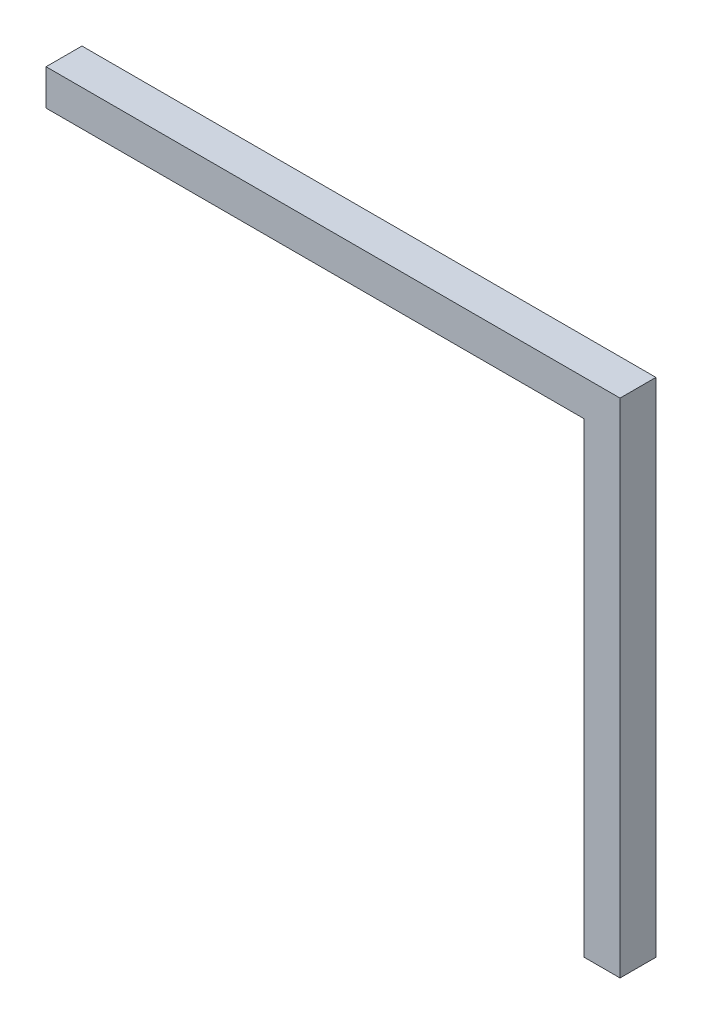
ISO-10303-21;
HEADER;
FILE_DESCRIPTION(('STEP AP214'),'2;1');
FILE_NAME('part.step','',(''),(''),'','','');
FILE_SCHEMA(('AUTOMOTIVE_DESIGN { 1 0 10303 214 1 1 1 1 }'));
ENDSEC;
DATA;
#1=APPLICATION_CONTEXT('core data for automotive mechanical design processes');
#2=APPLICATION_PROTOCOL_DEFINITION('international standard','automotive_design',2000,#1);
#3=PRODUCT_CONTEXT('',#1,'mechanical');
#4=PRODUCT('Part','Part','',(#3));
#5=PRODUCT_RELATED_PRODUCT_CATEGORY('part','',(#4));
#6=PRODUCT_DEFINITION_FORMATION('','',#4);
#7=PRODUCT_DEFINITION_CONTEXT('part definition',#1,'design');
#8=PRODUCT_DEFINITION('design','',#6,#7);
#9=PRODUCT_DEFINITION_SHAPE('','',#8);
#10=(LENGTH_UNIT() NAMED_UNIT(*) SI_UNIT(.MILLI.,.METRE.));
#11=(NAMED_UNIT(*) PLANE_ANGLE_UNIT() SI_UNIT($,.RADIAN.));
#12=(NAMED_UNIT(*) SI_UNIT($,.STERADIAN.) SOLID_ANGLE_UNIT());
#13=UNCERTAINTY_MEASURE_WITH_UNIT(LENGTH_MEASURE(1.E-05),#10,'distance_accuracy_value','');
#14=(GEOMETRIC_REPRESENTATION_CONTEXT(3) GLOBAL_UNCERTAINTY_ASSIGNED_CONTEXT((#13)) GLOBAL_UNIT_ASSIGNED_CONTEXT((#10,
#11,#12)) REPRESENTATION_CONTEXT('',''));
#15=CARTESIAN_POINT('',(0.,0.,0.));
#16=DIRECTION('',(0.,0.,1.));
#17=DIRECTION('',(1.,0.,0.));
#18=AXIS2_PLACEMENT_3D('',#15,#16,#17);
#19=CARTESIAN_POINT('',(-5.69999999999999,0.,0.5));
#20=DIRECTION('',(-1.,0.,0.));
#21=DIRECTION('',(0.,0.,1.));
#22=AXIS2_PLACEMENT_3D('',#19,#20,#21);
#23=PLANE('',#22);
#24=DIRECTION('',(0.,1.,0.));
#25=VECTOR('',#24,1.);
#26=CARTESIAN_POINT('',(-5.69999999999999,0.,0.));
#27=LINE('',#26,#25);
#28=CARTESIAN_POINT('',(-5.69999999999999,10.5626465300252,0.));
#29=VERTEX_POINT('',#28);
#30=CARTESIAN_POINT('',(-5.69999999999999,17.0626465300252,0.));
#31=VERTEX_POINT('',#30);
#32=EDGE_CURVE('E129',#29,#31,#27,.T.);
#33=ORIENTED_EDGE('',*,*,#32,.F.);
#34=DIRECTION('',(0.,0.,-1.));
#35=VECTOR('',#34,1.);
#36=CARTESIAN_POINT('',(-5.69999999999999,10.5626465300252,0.5));
#37=LINE('',#36,#35);
#38=CARTESIAN_POINT('',(-5.69999999999999,10.5626465300252,0.5));
#39=VERTEX_POINT('',#38);
#40=EDGE_CURVE('E11',#39,#29,#37,.T.);
#41=ORIENTED_EDGE('',*,*,#40,.F.);
#42=DIRECTION('',(0.,1.,0.));
#43=VECTOR('',#42,1.);
#44=CARTESIAN_POINT('',(-5.69999999999999,0.,0.5));
#45=LINE('',#44,#43);
#46=CARTESIAN_POINT('',(-5.69999999999999,17.0626465300252,0.5));
#47=VERTEX_POINT('',#46);
#48=EDGE_CURVE('E148',#39,#47,#45,.T.);
#49=ORIENTED_EDGE('',*,*,#48,.T.);
#50=DIRECTION('',(0.,0.,-1.));
#51=VECTOR('',#50,1.);
#52=CARTESIAN_POINT('',(-5.69999999999999,17.0626465300252,0.5));
#53=LINE('',#52,#51);
#54=EDGE_CURVE('E86',#47,#31,#53,.T.);
#55=ORIENTED_EDGE('',*,*,#54,.T.);
#56=EDGE_LOOP('',(#33,#41,#49,#55));
#57=FACE_BOUND('',#56,.T.);
#58=ADVANCED_FACE('F41',(#57),#23,.T.);
#59=CARTESIAN_POINT('',(0.,10.5626465300252,0.5));
#60=DIRECTION('',(0.,1.,0.));
#61=DIRECTION('',(0.,0.,1.));
#62=AXIS2_PLACEMENT_3D('',#59,#60,#61);
#63=PLANE('',#62);
#64=DIRECTION('',(1.,0.,0.));
#65=VECTOR('',#64,1.);
#66=CARTESIAN_POINT('',(0.,10.5626465300252,0.));
#67=LINE('',#66,#65);
#68=CARTESIAN_POINT('',(-5.19999999999999,10.5626465300252,0.));
#69=VERTEX_POINT('',#68);
#70=EDGE_CURVE('E133',#29,#69,#67,.T.);
#71=ORIENTED_EDGE('',*,*,#70,.T.);
#72=DIRECTION('',(0.,0.,-1.));
#73=VECTOR('',#72,1.);
#74=CARTESIAN_POINT('',(-5.19999999999999,10.5626465300252,0.5));
#75=LINE('',#74,#73);
#76=CARTESIAN_POINT('',(-5.19999999999999,10.5626465300252,0.5));
#77=VERTEX_POINT('',#76);
#78=EDGE_CURVE('E50',#77,#69,#75,.T.);
#79=ORIENTED_EDGE('',*,*,#78,.F.);
#80=DIRECTION('',(1.,0.,0.));
#81=VECTOR('',#80,1.);
#82=CARTESIAN_POINT('',(0.,10.5626465300252,0.5));
#83=LINE('',#82,#81);
#84=EDGE_CURVE('E123',#39,#77,#83,.T.);
#85=ORIENTED_EDGE('',*,*,#84,.F.);
#86=ORIENTED_EDGE('',*,*,#40,.T.);
#87=EDGE_LOOP('',(#71,#79,#85,#86));
#88=FACE_BOUND('',#87,.T.);
#89=ADVANCED_FACE('F161',(#88),#63,.F.);
#90=CARTESIAN_POINT('',(-5.19999999999999,0.,0.5));
#91=DIRECTION('',(1.,0.,0.));
#92=DIRECTION('',(0.,1.,0.));
#93=AXIS2_PLACEMENT_3D('',#90,#91,#92);
#94=PLANE('',#93);
#95=DIRECTION('',(0.,-1.,0.));
#96=VECTOR('',#95,1.);
#97=CARTESIAN_POINT('',(-5.19999999999999,0.,0.));
#98=LINE('',#97,#96);
#99=CARTESIAN_POINT('',(-5.19999999999999,17.5626465300252,0.));
#100=VERTEX_POINT('',#99);
#101=EDGE_CURVE('E137',#100,#69,#98,.T.);
#102=ORIENTED_EDGE('',*,*,#101,.F.);
#103=DIRECTION('',(0.,0.,-1.));
#104=VECTOR('',#103,1.);
#105=CARTESIAN_POINT('',(-5.19999999999999,17.5626465300252,0.5));
#106=LINE('',#105,#104);
#107=CARTESIAN_POINT('',(-5.19999999999999,17.5626465300252,0.5));
#108=VERTEX_POINT('',#107);
#109=EDGE_CURVE('E109',#108,#100,#106,.T.);
#110=ORIENTED_EDGE('',*,*,#109,.F.);
#111=DIRECTION('',(0.,-1.,0.));
#112=VECTOR('',#111,1.);
#113=CARTESIAN_POINT('',(-5.19999999999999,0.,0.5));
#114=LINE('',#113,#112);
#115=EDGE_CURVE('E119',#108,#77,#114,.T.);
#116=ORIENTED_EDGE('',*,*,#115,.T.);
#117=ORIENTED_EDGE('',*,*,#78,.T.);
#118=EDGE_LOOP('',(#102,#110,#116,#117));
#119=FACE_BOUND('',#118,.T.);
#120=ADVANCED_FACE('F158',(#119),#94,.T.);
#121=CARTESIAN_POINT('',(0.,17.5626465300252,0.5));
#122=DIRECTION('',(0.,1.,0.));
#123=DIRECTION('',(0.,0.,1.));
#124=AXIS2_PLACEMENT_3D('',#121,#122,#123);
#125=PLANE('',#124);
#126=DIRECTION('',(1.,0.,0.));
#127=VECTOR('',#126,1.);
#128=CARTESIAN_POINT('',(0.,17.5626465300252,0.));
#129=LINE('',#128,#127);
#130=CARTESIAN_POINT('',(-13.2,17.5626465300252,0.));
#131=VERTEX_POINT('',#130);
#132=EDGE_CURVE('E107',#131,#100,#129,.T.);
#133=ORIENTED_EDGE('',*,*,#132,.F.);
#134=DIRECTION('',(0.,0.,-1.));
#135=VECTOR('',#134,1.);
#136=CARTESIAN_POINT('',(-13.2,17.5626465300252,0.5));
#137=LINE('',#136,#135);
#138=CARTESIAN_POINT('',(-13.2,17.5626465300252,0.5));
#139=VERTEX_POINT('',#138);
#140=EDGE_CURVE('E101',#139,#131,#137,.T.);
#141=ORIENTED_EDGE('',*,*,#140,.F.);
#142=DIRECTION('',(1.,0.,0.));
#143=VECTOR('',#142,1.);
#144=CARTESIAN_POINT('',(0.,17.5626465300252,0.5));
#145=LINE('',#144,#143);
#146=EDGE_CURVE('E105',#139,#108,#145,.T.);
#147=ORIENTED_EDGE('',*,*,#146,.T.);
#148=ORIENTED_EDGE('',*,*,#109,.T.);
#149=EDGE_LOOP('',(#133,#141,#147,#148));
#150=FACE_BOUND('',#149,.T.);
#151=ADVANCED_FACE('F103',(#150),#125,.T.);
#152=CARTESIAN_POINT('',(-13.2,0.,0.5));
#153=DIRECTION('',(1.,0.,0.));
#154=DIRECTION('',(0.,0.,-1.));
#155=AXIS2_PLACEMENT_3D('',#152,#153,#154);
#156=PLANE('',#155);
#157=DIRECTION('',(0.,-1.,0.));
#158=VECTOR('',#157,1.);
#159=CARTESIAN_POINT('',(-13.2,0.,0.));
#160=LINE('',#159,#158);
#161=CARTESIAN_POINT('',(-13.2,17.0626465300252,0.));
#162=VERTEX_POINT('',#161);
#163=EDGE_CURVE('E79',#131,#162,#160,.T.);
#164=ORIENTED_EDGE('',*,*,#163,.T.);
#165=DIRECTION('',(0.,0.,-1.));
#166=VECTOR('',#165,1.);
#167=CARTESIAN_POINT('',(-13.2,17.0626465300252,0.5));
#168=LINE('',#167,#166);
#169=CARTESIAN_POINT('',(-13.2,17.0626465300252,0.5));
#170=VERTEX_POINT('',#169);
#171=EDGE_CURVE('E110',#170,#162,#168,.T.);
#172=ORIENTED_EDGE('',*,*,#171,.F.);
#173=DIRECTION('',(0.,-1.,0.));
#174=VECTOR('',#173,1.);
#175=CARTESIAN_POINT('',(-13.2,0.,0.5));
#176=LINE('',#175,#174);
#177=EDGE_CURVE('E112',#139,#170,#176,.T.);
#178=ORIENTED_EDGE('',*,*,#177,.F.);
#179=ORIENTED_EDGE('',*,*,#140,.T.);
#180=EDGE_LOOP('',(#164,#172,#178,#179));
#181=FACE_BOUND('',#180,.T.);
#182=ADVANCED_FACE('F113',(#181),#156,.F.);
#183=CARTESIAN_POINT('',(0.,17.0626465300252,0.5));
#184=DIRECTION('',(0.,1.,0.));
#185=DIRECTION('',(0.,0.,1.));
#186=AXIS2_PLACEMENT_3D('',#183,#184,#185);
#187=PLANE('',#186);
#188=DIRECTION('',(1.,0.,0.));
#189=VECTOR('',#188,1.);
#190=CARTESIAN_POINT('',(0.,17.0626465300252,0.));
#191=LINE('',#190,#189);
#192=EDGE_CURVE('E145',#162,#31,#191,.T.);
#193=ORIENTED_EDGE('',*,*,#192,.T.);
#194=ORIENTED_EDGE('',*,*,#54,.F.);
#195=DIRECTION('',(1.,0.,0.));
#196=VECTOR('',#195,1.);
#197=CARTESIAN_POINT('',(0.,17.0626465300252,0.5));
#198=LINE('',#197,#196);
#199=EDGE_CURVE('E58',#170,#47,#198,.T.);
#200=ORIENTED_EDGE('',*,*,#199,.F.);
#201=ORIENTED_EDGE('',*,*,#171,.T.);
#202=EDGE_LOOP('',(#193,#194,#200,#201));
#203=FACE_BOUND('',#202,.T.);
#204=ADVANCED_FACE('F166',(#203),#187,.F.);
#205=CARTESIAN_POINT('',(0.,0.,0.5));
#206=DIRECTION('',(0.,0.,1.));
#207=DIRECTION('',(1.,0.,0.));
#208=AXIS2_PLACEMENT_3D('',#205,#206,#207);
#209=PLANE('',#208);
#210=ORIENTED_EDGE('',*,*,#48,.F.);
#211=ORIENTED_EDGE('',*,*,#84,.T.);
#212=ORIENTED_EDGE('',*,*,#115,.F.);
#213=ORIENTED_EDGE('',*,*,#146,.F.);
#214=ORIENTED_EDGE('',*,*,#177,.T.);
#215=ORIENTED_EDGE('',*,*,#199,.T.);
#216=EDGE_LOOP('',(#210,#211,#212,#213,#214,#215));
#217=FACE_BOUND('',#216,.T.);
#218=ADVANCED_FACE('F117',(#217),#209,.T.);
#219=CARTESIAN_POINT('',(0.,0.,0.));
#220=DIRECTION('',(0.,0.,1.));
#221=DIRECTION('',(1.,0.,0.));
#222=AXIS2_PLACEMENT_3D('',#219,#220,#221);
#223=PLANE('',#222);
#224=ORIENTED_EDGE('',*,*,#32,.T.);
#225=ORIENTED_EDGE('',*,*,#192,.F.);
#226=ORIENTED_EDGE('',*,*,#163,.F.);
#227=ORIENTED_EDGE('',*,*,#132,.T.);
#228=ORIENTED_EDGE('',*,*,#101,.T.);
#229=ORIENTED_EDGE('',*,*,#70,.F.);
#230=EDGE_LOOP('',(#224,#225,#226,#227,#228,#229));
#231=FACE_BOUND('',#230,.T.);
#232=ADVANCED_FACE('F163',(#231),#223,.F.);
#233=CLOSED_SHELL('',(#58,#89,#120,#151,#182,#204,#218,#232));
#234=MANIFOLD_SOLID_BREP('B2',#233);
#235=ADVANCED_BREP_SHAPE_REPRESENTATION('',(#18,#234),#14);
#236=SHAPE_DEFINITION_REPRESENTATION(#9,#235);
ENDSEC;
END-ISO-10303-21;
